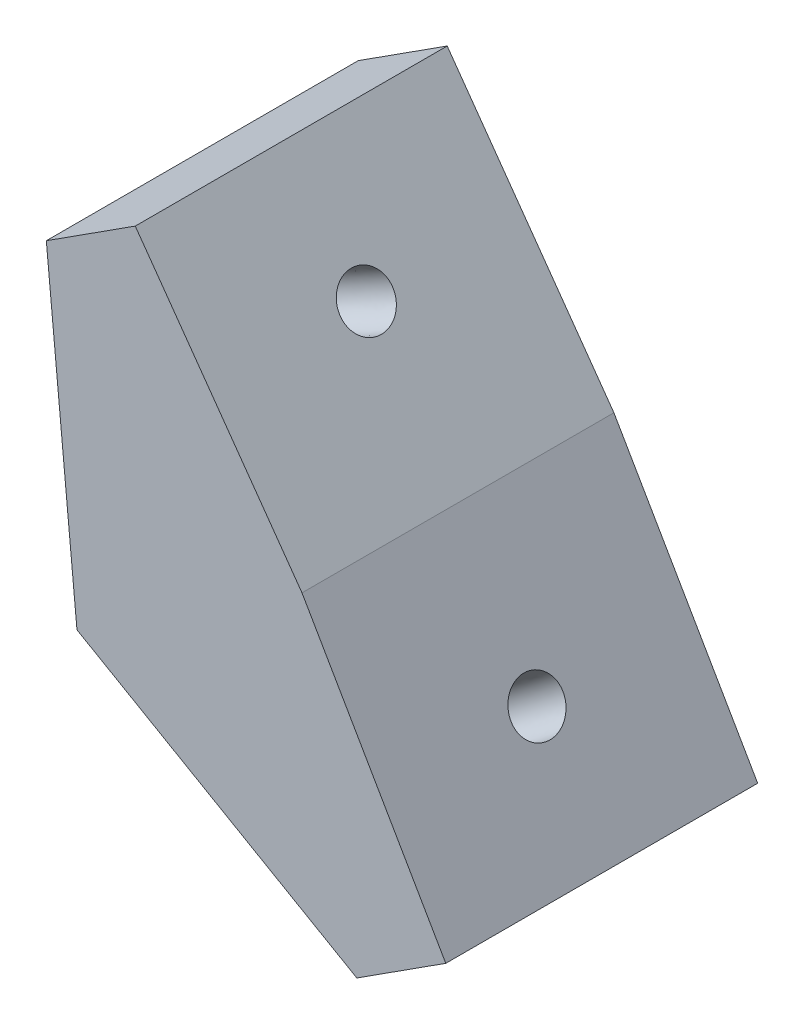
ISO-10303-21;
HEADER;
FILE_DESCRIPTION(('STEP AP214'),'2;1');
FILE_NAME('part.step','',(''),(''),'','','');
FILE_SCHEMA(('AUTOMOTIVE_DESIGN { 1 0 10303 214 1 1 1 1 }'));
ENDSEC;
DATA;
#1=APPLICATION_CONTEXT('core data for automotive mechanical design processes');
#2=APPLICATION_PROTOCOL_DEFINITION('international standard','automotive_design',2000,#1);
#3=PRODUCT_CONTEXT('',#1,'mechanical');
#4=PRODUCT('Part','Part','',(#3));
#5=PRODUCT_RELATED_PRODUCT_CATEGORY('part','',(#4));
#6=PRODUCT_DEFINITION_FORMATION('','',#4);
#7=PRODUCT_DEFINITION_CONTEXT('part definition',#1,'design');
#8=PRODUCT_DEFINITION('design','',#6,#7);
#9=PRODUCT_DEFINITION_SHAPE('','',#8);
#10=(LENGTH_UNIT() NAMED_UNIT(*) SI_UNIT(.MILLI.,.METRE.));
#11=(NAMED_UNIT(*) PLANE_ANGLE_UNIT() SI_UNIT($,.RADIAN.));
#12=(NAMED_UNIT(*) SI_UNIT($,.STERADIAN.) SOLID_ANGLE_UNIT());
#13=UNCERTAINTY_MEASURE_WITH_UNIT(LENGTH_MEASURE(1.E-05),#10,'distance_accuracy_value','');
#14=(GEOMETRIC_REPRESENTATION_CONTEXT(3) GLOBAL_UNCERTAINTY_ASSIGNED_CONTEXT((#13)) GLOBAL_UNIT_ASSIGNED_CONTEXT((#10,
#11,#12)) REPRESENTATION_CONTEXT('',''));
#15=CARTESIAN_POINT('',(0.,0.,0.));
#16=DIRECTION('',(0.,0.,1.));
#17=DIRECTION('',(1.,0.,0.));
#18=AXIS2_PLACEMENT_3D('',#15,#16,#17);
#19=CARTESIAN_POINT('',(-8.04908347678806,7.82676257019965,7.5));
#20=DIRECTION('',(-0.866025403784439,-0.499999999999999,0.));
#21=DIRECTION('',(0.499999999999999,-0.866025403784439,0.));
#22=AXIS2_PLACEMENT_3D('',#19,#20,#21);
#23=PLANE('',#22);
#24=DIRECTION('',(-0.499999999999999,0.866025403784439,0.));
#25=VECTOR('',#24,1.);
#26=CARTESIAN_POINT('',(-8.04908347678806,7.82676257019965,-7.5));
#27=LINE('',#26,#25);
#28=CARTESIAN_POINT('',(-8.04908347678806,7.82676257019965,-7.5));
#29=VERTEX_POINT('',#28);
#30=CARTESIAN_POINT('',(-14.9625241732557,19.801193111596,-7.5));
#31=VERTEX_POINT('',#30);
#32=EDGE_CURVE('E153',#29,#31,#27,.T.);
#33=ORIENTED_EDGE('',*,*,#32,.T.);
#34=DIRECTION('',(0.,0.,-1.));
#35=VECTOR('',#34,1.);
#36=CARTESIAN_POINT('',(-14.9625241732557,19.801193111596,7.5));
#37=LINE('',#36,#35);
#38=CARTESIAN_POINT('',(-14.9625241732557,19.801193111596,7.5));
#39=VERTEX_POINT('',#38);
#40=EDGE_CURVE('E123',#39,#31,#37,.T.);
#41=ORIENTED_EDGE('',*,*,#40,.F.);
#42=DIRECTION('',(-0.499999999999999,0.866025403784439,0.));
#43=VECTOR('',#42,1.);
#44=CARTESIAN_POINT('',(-8.04908347678806,7.82676257019965,7.5));
#45=LINE('',#44,#43);
#46=CARTESIAN_POINT('',(-8.04908347678806,7.82676257019965,7.5));
#47=VERTEX_POINT('',#46);
#48=EDGE_CURVE('E86',#47,#39,#45,.T.);
#49=ORIENTED_EDGE('',*,*,#48,.F.);
#50=DIRECTION('',(0.,0.,-1.));
#51=VECTOR('',#50,1.);
#52=CARTESIAN_POINT('',(-8.04908347678806,7.82676257019965,7.5));
#53=LINE('',#52,#51);
#54=EDGE_CURVE('E11',#47,#29,#53,.T.);
#55=ORIENTED_EDGE('',*,*,#54,.T.);
#56=EDGE_LOOP('',(#33,#41,#49,#55));
#57=FACE_BOUND('',#56,.T.);
#58=CARTESIAN_POINT('',(-11.7882920789333,14.3032618492139,0.));
#59=CARTESIAN_POINT('',(-11.7882903877033,14.3032589199176,0.0692359962382509));
#60=CARTESIAN_POINT('',(-11.7854052994968,14.2982618005596,0.138544678433381));
#61=CARTESIAN_POINT('',(-11.7739405095316,14.2784042018417,0.275212310269475));
#62=CARTESIAN_POINT('',(-11.7653608077728,14.2635437224818,0.342571259910438));
#63=CARTESIAN_POINT('',(-11.7427454118136,14.2243727076471,0.473530737806469));
#64=CARTESIAN_POINT('',(-11.7287097176131,14.2000621721723,0.537131266061537));
#65=CARTESIAN_POINT('',(-11.6955689293954,14.1426606431763,0.658806539190552));
#66=CARTESIAN_POINT('',(-11.6764638353782,14.1095696496552,0.716881284064499));
#67=CARTESIAN_POINT('',(-11.6337113342174,14.0355201454941,0.825906739801367));
#68=CARTESIAN_POINT('',(-11.6100639270738,13.9945616348541,0.876857450664289));
#69=CARTESIAN_POINT('',(-11.5588789891499,13.9059067217877,0.970228602792982));
#70=CARTESIAN_POINT('',(-11.5313414583697,13.8582103193613,1.01264904405875));
#71=CARTESIAN_POINT('',(-11.4731358058845,13.7573951719691,1.08778989703168));
#72=CARTESIAN_POINT('',(-11.4424676841794,13.7042764270034,1.12051030873884));
#73=CARTESIAN_POINT('',(-11.3788467155563,13.5940816769214,1.17534856129659));
#74=CARTESIAN_POINT('',(-11.3458938686382,13.5370056718052,1.19746640214719));
#75=CARTESIAN_POINT('',(-11.2786123345948,13.4204706364308,1.23048949109687));
#76=CARTESIAN_POINT('',(-11.2442836474695,13.3610116061727,1.24139473919595));
#77=CARTESIAN_POINT('',(-11.1751972646293,13.2413504809824,1.25169185621386));
#78=CARTESIAN_POINT('',(-11.1404395689145,13.1811483860502,1.25108372513269));
#79=CARTESIAN_POINT('',(-11.0714538334015,13.0616615871443,1.23837085817757));
#80=CARTESIAN_POINT('',(-11.0372257936034,13.0023768831705,1.22626612230363));
#81=CARTESIAN_POINT('',(-10.9702434257341,12.8863600188095,1.19089391046827));
#82=CARTESIAN_POINT('',(-10.9374890976628,12.8296278584223,1.16762643450686));
#83=CARTESIAN_POINT('',(-10.8743575621041,12.7202808312747,1.11057049117791));
#84=CARTESIAN_POINT('',(-10.8439803546166,12.6676659645143,1.07678202381037));
#85=CARTESIAN_POINT('',(-10.7864409048635,12.5680047141024,0.999616029463532));
#86=CARTESIAN_POINT('',(-10.7592786625978,12.5209583304508,0.956238502484234));
#87=CARTESIAN_POINT('',(-10.7089183148205,12.4337316494136,0.861090800027518));
#88=CARTESIAN_POINT('',(-10.6857202093089,12.3935513520281,0.809320624550101));
#89=CARTESIAN_POINT('',(-10.6439279702957,12.3211650706952,0.698815516846221));
#90=CARTESIAN_POINT('',(-10.6253338367942,12.2889590867479,0.640080584619759));
#91=CARTESIAN_POINT('',(-10.5932623932569,12.2334097170692,0.517265952619418));
#92=CARTESIAN_POINT('',(-10.5797850832211,12.2100663313378,0.45318625284554));
#93=CARTESIAN_POINT('',(-10.5583190091299,12.1728860003729,0.321449490899288));
#94=CARTESIAN_POINT('',(-10.5503302450746,12.1590490551394,0.253792428726914));
#95=CARTESIAN_POINT('',(-10.5400616039071,12.1412632469125,0.116767015646271));
#96=CARTESIAN_POINT('',(-10.5377817267948,12.1373143839191,0.0473986647380021));
#97=CARTESIAN_POINT('',(-10.5389937416205,12.1394136551767,-0.091136052484365));
#98=CARTESIAN_POINT('',(-10.5424856335584,12.1454617894277,-0.160302418798464));
#99=CARTESIAN_POINT('',(-10.5551448753623,12.1673882394174,-0.29652546451185));
#100=CARTESIAN_POINT('',(-10.5643122252283,12.1832665551561,-0.363582143911137));
#101=CARTESIAN_POINT('',(-10.5880695349285,12.224415422608,-0.493736301504609));
#102=CARTESIAN_POINT('',(-10.6026594947627,12.2496859743212,-0.556833779698793));
#103=CARTESIAN_POINT('',(-10.6368596134919,12.308922317585,-0.677329220738223));
#104=CARTESIAN_POINT('',(-10.6564697723868,12.3428881091355,-0.734727183583468));
#105=CARTESIAN_POINT('',(-10.7001694144218,12.4185781094127,-0.842240480155007));
#106=CARTESIAN_POINT('',(-10.7242588975618,12.4603023181393,-0.8923558138813));
#107=CARTESIAN_POINT('',(-10.7762527674249,12.5503583424242,-0.983921603247795));
#108=CARTESIAN_POINT('',(-10.8041571541479,12.5986901579825,-1.025372058888));
#109=CARTESIAN_POINT('',(-10.8630111902937,12.7006283388176,-1.09846483221743));
#110=CARTESIAN_POINT('',(-10.8939608397165,12.7542347040943,-1.13010714990666));
#111=CARTESIAN_POINT('',(-10.9580517678942,12.8652434480023,-1.18271090924779));
#112=CARTESIAN_POINT('',(-10.991193046649,12.9226458266335,-1.20367235089969));
#113=CARTESIAN_POINT('',(-11.058753152022,13.0396633617041,-1.23433621309854));
#114=CARTESIAN_POINT('',(-11.0931719786401,13.0992785181436,-1.24403863364549));
#115=CARTESIAN_POINT('',(-11.1623378617193,13.2190773417873,-1.2519168478413));
#116=CARTESIAN_POINT('',(-11.1970849181805,13.2792610089915,-1.25009264149015));
#117=CARTESIAN_POINT('',(-11.2659488900731,13.3985369071204,-1.23496791544555));
#118=CARTESIAN_POINT('',(-11.3000658055044,13.457629138045,-1.22166739575209));
#119=CARTESIAN_POINT('',(-11.3667285039678,13.5730923187532,-1.18395689140882));
#120=CARTESIAN_POINT('',(-11.3992742869999,13.6294632685369,-1.15954690675901));
#121=CARTESIAN_POINT('',(-11.4618970656563,13.7379291028809,-1.10029072560949));
#122=CARTESIAN_POINT('',(-11.4919740612807,13.7900239874414,-1.06544452910978));
#123=CARTESIAN_POINT('',(-11.5488296936821,13.8885008314571,-0.986277057386749));
#124=CARTESIAN_POINT('',(-11.5756083304592,13.9348827909125,-0.941955782163436));
#125=CARTESIAN_POINT('',(-11.6251286803112,14.0206545528647,-0.84506049057769));
#126=CARTESIAN_POINT('',(-11.6478703933861,14.0600443553616,-0.792486474215257));
#127=CARTESIAN_POINT('',(-11.6886895502857,14.1307452090338,-0.680536148947652));
#128=CARTESIAN_POINT('',(-11.7067669941104,14.1620562602092,-0.621159840042481));
#129=CARTESIAN_POINT('',(-11.7377593786004,14.2157366447937,-0.49724116902249));
#130=CARTESIAN_POINT('',(-11.7506743192658,14.2381059782028,-0.43269880690767));
#131=CARTESIAN_POINT('',(-11.7698166937878,14.2712615434524,-0.307847781127855));
#132=CARTESIAN_POINT('',(-11.776642248308,14.2830837506712,-0.247905408153965));
#133=CARTESIAN_POINT('',(-11.7835765050165,14.2950942356031,-0.156421509780714));
#134=CARTESIAN_POINT('',(-11.785337645046,14.2981446196134,-0.125351349232774));
#135=CARTESIAN_POINT('',(-11.7876991401056,14.3022348490385,-0.0628597828360439));
#136=CARTESIAN_POINT('',(-11.7882928468554,14.3032631792939,-0.0314373843093596));
#137=CARTESIAN_POINT('',(-11.7882920789333,14.3032618492139,0.));
#138=B_SPLINE_CURVE_WITH_KNOTS('',3,(#58,#59,#60,#61,#62,#63,#64,#65,#66,#67,#68,#69,#70,#71,
#72,#73,#74,#75,#76,#77,#78,#79,#80,#81,#82,#83,#84,#85,#86,#87,#88,#89,#90,#91,#92,#93,#94,#95,
#96,#97,#98,#99,#100,#101,#102,#103,#104,#105,#106,#107,#108,#109,#110,#111,#112,#113,#114,#115,
#116,#117,#118,#119,#120,#121,#122,#123,#124,#125,#126,#127,#128,#129,#130,#131,#132,#133,#134,
#135,#136,#137),.UNSPECIFIED.,.T.,.F.,(4,2,2,2,2,2,2,2,2,2,2,2,2,2,2,2,2,2,2,2,2,2,2,2,2,2,2,2,
2,2,2,2,2,2,2,2,2,2,2,4),(0.,0.207595452974777,0.415190905949554,0.62278635892433,
0.830381811899108,1.03797726487388,1.24557271784866,1.45316817082343,1.66076362379821,
1.86835907677298,2.07595452974775,2.28354998272253,2.4911454356973,2.69874088867207,
2.90633634164685,3.11393179462163,3.3215272475964,3.52912270057118,3.73671815354596,
3.94431360652073,4.15190905949551,4.35950451247028,4.56709996544506,4.77469541841983,
4.98229087139461,5.18988632436938,5.39748177734416,5.60507723031893,5.81267268329371,
6.02026813626848,6.22786358924325,6.43545904221803,6.6430544951928,6.85064994816757,
7.05824540114235,7.26584085411712,7.4734363070919,7.65716624205797,7.75089505982163,
7.84515611462863),.UNSPECIFIED.);
#139=CARTESIAN_POINT('',(-11.7882920789333,14.3032618492139,0.));
#140=VERTEX_POINT('',#139);
#141=EDGE_CURVE('E162',#140,#140,#138,.T.);
#142=ORIENTED_EDGE('',*,*,#141,.F.);
#143=EDGE_LOOP('',(#142));
#144=FACE_BOUND('',#143,.T.);
#145=ADVANCED_FACE('F38',(#57,#144),#23,.F.);
#146=CARTESIAN_POINT('',(-25.7839240841938,12.848135855454,7.5));
#147=DIRECTION('',(0.499999999999999,0.866025403784439,0.));
#148=DIRECTION('',(-0.866025403784439,0.5,0.));
#149=AXIS2_PLACEMENT_3D('',#146,#147,#148);
#150=PLANE('',#149);
#151=DIRECTION('',(0.866025403784439,-0.499999999999999,0.));
#152=VECTOR('',#151,1.);
#153=CARTESIAN_POINT('',(-25.7839240841938,12.848135855454,-7.5));
#154=LINE('',#153,#152);
#155=CARTESIAN_POINT('',(-25.7839240841938,12.848135855454,-7.5));
#156=VERTEX_POINT('',#155);
#157=CARTESIAN_POINT('',(-12.3261586807003,5.0782913770562,-7.5));
#158=VERTEX_POINT('',#157);
#159=EDGE_CURVE('E79',#156,#158,#154,.T.);
#160=ORIENTED_EDGE('',*,*,#159,.T.);
#161=DIRECTION('',(0.,0.,-1.));
#162=VECTOR('',#161,1.);
#163=CARTESIAN_POINT('',(-12.3261586807003,5.0782913770562,7.5));
#164=LINE('',#163,#162);
#165=CARTESIAN_POINT('',(-12.3261586807003,5.0782913770562,7.5));
#166=VERTEX_POINT('',#165);
#167=EDGE_CURVE('E53',#166,#158,#164,.T.);
#168=ORIENTED_EDGE('',*,*,#167,.F.);
#169=DIRECTION('',(0.866025403784439,-0.499999999999999,0.));
#170=VECTOR('',#169,1.);
#171=CARTESIAN_POINT('',(-25.7839240841938,12.848135855454,7.5));
#172=LINE('',#171,#170);
#173=CARTESIAN_POINT('',(-25.7839240841938,12.848135855454,7.5));
#174=VERTEX_POINT('',#173);
#175=EDGE_CURVE('E62',#174,#166,#172,.T.);
#176=ORIENTED_EDGE('',*,*,#175,.F.);
#177=DIRECTION('',(0.,0.,-1.));
#178=VECTOR('',#177,1.);
#179=CARTESIAN_POINT('',(-25.7839240841938,12.848135855454,7.5));
#180=LINE('',#179,#178);
#181=EDGE_CURVE('E76',#174,#156,#180,.T.);
#182=ORIENTED_EDGE('',*,*,#181,.T.);
#183=EDGE_LOOP('',(#160,#168,#176,#182));
#184=FACE_BOUND('',#183,.T.);
#185=CARTESIAN_POINT('',(-18.9694980877571,8.91382517203852,0.));
#186=CARTESIAN_POINT('',(-18.9695002867095,8.91382644160426,-0.0326198593364432));
#187=CARTESIAN_POINT('',(-18.9683069101205,8.91313744530941,-0.0652249759464828));
#188=CARTESIAN_POINT('',(-18.9611998724466,8.90903419519516,-0.162058894340575));
#189=CARTESIAN_POINT('',(-18.9518090596245,8.90361240688433,-0.226000253886946));
#190=CARTESIAN_POINT('',(-18.9238625697643,8.88747749344087,-0.352028601236673));
#191=CARTESIAN_POINT('',(-18.905183807905,8.8766933052536,-0.41407847052515));
#192=CARTESIAN_POINT('',(-18.8592997326005,8.85020212202414,-0.533849840437851));
#193=CARTESIAN_POINT('',(-18.8320940121261,8.83449489198345,-0.591571134277046));
#194=CARTESIAN_POINT('',(-18.7853974878147,8.80753464110281,-0.674262576103965));
#195=CARTESIAN_POINT('',(-18.7686883907982,8.79788763944314,-0.701384232354124));
#196=CARTESIAN_POINT('',(-18.7334667333901,8.77755240605783,-0.754006779519602));
#197=CARTESIAN_POINT('',(-18.7149547001531,8.76686447868502,-0.779508140605713));
#198=CARTESIAN_POINT('',(-18.6564820722562,8.73310529122823,-0.85394481906787));
#199=CARTESIAN_POINT('',(-18.6139271484951,8.70853619453955,-0.900210371413862));
#200=CARTESIAN_POINT('',(-18.5232141838408,8.65616303997752,-0.984759288054414));
#201=CARTESIAN_POINT('',(-18.4750521777345,8.62835669278725,-1.02303694940061));
#202=CARTESIAN_POINT('',(-18.3973239300165,8.58348026804363,-1.07552936951723));
#203=CARTESIAN_POINT('',(-18.3692587359313,8.56727682068365,-1.09277199291995));
#204=CARTESIAN_POINT('',(-18.3120652005034,8.53425611760849,-1.12462931901239));
#205=CARTESIAN_POINT('',(-18.2829378740989,8.51743944786811,-1.13924645526445));
#206=CARTESIAN_POINT('',(-18.1942022633774,8.46620791913133,-1.17909807797935));
#207=CARTESIAN_POINT('',(-18.133213542946,8.4309960649727,-1.20035075031548));
#208=CARTESIAN_POINT('',(-18.0091893211891,8.3593906471553,-1.23188973708283));
#209=CARTESIAN_POINT('',(-17.9461540324134,8.32299720621223,-1.24217718659547));
#210=CARTESIAN_POINT('',(-17.819457821768,8.24984911489081,-1.2516877712256));
#211=CARTESIAN_POINT('',(-17.7557969242245,8.21309447855722,-1.25091133486448));
#212=CARTESIAN_POINT('',(-17.6292992467414,8.14006101041047,-1.2382988811288));
#213=CARTESIAN_POINT('',(-17.5664624884536,8.10378219109802,-1.22646257377607));
#214=CARTESIAN_POINT('',(-17.4430698209726,8.03254140131186,-1.19186924212257));
#215=CARTESIAN_POINT('',(-17.3825141200573,7.99757955108743,-1.16911122318086));
#216=CARTESIAN_POINT('',(-17.2651908958978,7.92984295603677,-1.11296899676825));
#217=CARTESIAN_POINT('',(-17.2084239613854,7.89706855111495,-1.07958314247999));
#218=CARTESIAN_POINT('',(-17.1002445738222,7.83461115258458,-1.00269266681163));
#219=CARTESIAN_POINT('',(-17.0488332748062,7.80492882525831,-0.959185871069453));
#220=CARTESIAN_POINT('',(-16.9542691061278,7.75033217701616,-0.864147431746054));
#221=CARTESIAN_POINT('',(-16.9109332057154,7.72531218324753,-0.812859533504096));
#222=CARTESIAN_POINT('',(-16.833770387903,7.68076220961209,-0.704559603336214));
#223=CARTESIAN_POINT('',(-16.799657857624,7.66106733107274,-0.647819303655092));
#224=CARTESIAN_POINT('',(-16.7410875385535,7.62725174159089,-0.530304640154718));
#225=CARTESIAN_POINT('',(-16.716365257798,7.61297832614171,-0.469707840126556));
#226=CARTESIAN_POINT('',(-16.6863886018341,7.59567129575149,-0.376654924253461));
#227=CARTESIAN_POINT('',(-16.677642995567,7.59062201761893,-0.345649948251011));
#228=CARTESIAN_POINT('',(-16.6624002008203,7.58182158596871,-0.282878682071813));
#229=CARTESIAN_POINT('',(-16.6559051943138,7.57807169221384,-0.25111168482818));
#230=CARTESIAN_POINT('',(-16.6399111114599,7.56883750417271,-0.154971774267373));
#231=CARTESIAN_POINT('',(-16.6339084251387,7.56537185160927,-0.0897768355313695));
#232=CARTESIAN_POINT('',(-16.6315186425485,7.56399210998751,0.0408347579416641));
#233=CARTESIAN_POINT('',(-16.6351293895364,7.56607677573298,0.106251359660802));
#234=CARTESIAN_POINT('',(-16.6475498753073,7.57324774653629,0.20261402374578));
#235=CARTESIAN_POINT('',(-16.6527951818168,7.57627612566152,0.23421992269247));
#236=CARTESIAN_POINT('',(-16.6655166768926,7.58362088426801,0.296822863825483));
#237=CARTESIAN_POINT('',(-16.6729925534139,7.58793708359002,0.327819990529793));
#238=CARTESIAN_POINT('',(-16.6988944280026,7.60289153785626,0.420381170245223));
#239=CARTESIAN_POINT('',(-16.7206924688531,7.61547664260895,0.480728899783467));
#240=CARTESIAN_POINT('',(-16.7724127198131,7.64533734342371,0.596595540945654));
#241=CARTESIAN_POINT('',(-16.802338503497,7.66261500268993,0.65211231430298));
#242=CARTESIAN_POINT('',(-16.8530495731449,7.69189305240168,0.731616771320882));
#243=CARTESIAN_POINT('',(-16.8712457293951,7.7023986081106,0.757856219514332));
#244=CARTESIAN_POINT('',(-16.9093703945516,7.72440989380119,0.808583963020048));
#245=CARTESIAN_POINT('',(-16.9292983284848,7.73591529182196,0.833072834662534));
#246=CARTESIAN_POINT('',(-16.9919311617943,7.77207637499349,0.904268230283434));
#247=CARTESIAN_POINT('',(-17.0371117132823,7.79816137855712,0.948121569803371));
#248=CARTESIAN_POINT('',(-17.1327157531572,7.85335839671453,1.0274391762351));
#249=CARTESIAN_POINT('',(-17.1831429466891,7.88247255047467,1.06289745592901));
#250=CARTESIAN_POINT('',(-17.2641473069471,7.92924043967516,1.11081950388115));
#251=CARTESIAN_POINT('',(-17.2933633377234,7.94610832290848,1.12642163030772));
#252=CARTESIAN_POINT('',(-17.3527439103014,7.980391712471,1.154893247797));
#253=CARTESIAN_POINT('',(-17.3829075478749,7.9978066967438,1.16776525820702));
#254=CARTESIAN_POINT('',(-17.474576005499,8.0507315054293,1.2022337022968));
#255=CARTESIAN_POINT('',(-17.5372857273035,8.08693698019392,1.21969861611969));
#256=CARTESIAN_POINT('',(-17.6642411742625,8.16023474167083,1.2433242585314));
#257=CARTESIAN_POINT('',(-17.7284867722017,8.19732695493524,1.24948592009621));
#258=CARTESIAN_POINT('',(-17.8570484683909,8.27155208483756,1.25045212787454));
#259=CARTESIAN_POINT('',(-17.9213645656209,8.30868500088649,1.24525683631504));
#260=CARTESIAN_POINT('',(-18.0485585670285,8.38212049183851,1.22356509087975));
#261=CARTESIAN_POINT('',(-18.1114363933282,8.41842302177869,1.20706802653692));
#262=CARTESIAN_POINT('',(-18.2342242719054,8.48931463652848,1.16297774970102));
#263=CARTESIAN_POINT('',(-18.2941339610545,8.52390351168575,1.1353831832615));
#264=CARTESIAN_POINT('',(-18.4093954628623,8.59044977078165,1.06948655053788));
#265=CARTESIAN_POINT('',(-18.4647464158992,8.62240665841738,1.03118247076263));
#266=CARTESIAN_POINT('',(-18.5682973307305,8.68219180697008,0.945294107100679));
#267=CARTESIAN_POINT('',(-18.6166065333009,8.71008313807839,0.897886101819199));
#268=CARTESIAN_POINT('',(-18.7039628421619,8.76051832651467,0.79626222568349));
#269=CARTESIAN_POINT('',(-18.7432882895151,8.78322288413006,0.742366387263723));
#270=CARTESIAN_POINT('',(-18.8123331404455,8.82308594740091,0.629630870101635));
#271=CARTESIAN_POINT('',(-18.8423331630292,8.84040646851534,0.571020932541889));
#272=CARTESIAN_POINT('',(-18.8926772462679,8.86947263852533,0.450472764172556));
#273=CARTESIAN_POINT('',(-18.9132648578936,8.88135890163936,0.388670958306316));
#274=CARTESIAN_POINT('',(-18.9425321330225,8.8982563708135,0.272543511663546));
#275=CARTESIAN_POINT('',(-18.9526235817647,8.90408267146133,0.218685977252467));
#276=CARTESIAN_POINT('',(-18.966102321146,8.91186462527151,0.109871160279212));
#277=CARTESIAN_POINT('',(-18.9694943858777,8.91382303475745,0.0549146890688752));
#278=CARTESIAN_POINT('',(-18.9694980877571,8.91382517203852,0.));
#279=B_SPLINE_CURVE_WITH_KNOTS('',3,(#185,#186,#187,#188,#189,#190,#191,#192,#193,#194,#195,
#196,#197,#198,#199,#200,#201,#202,#203,#204,#205,#206,#207,#208,#209,#210,#211,#212,#213,#214,
#215,#216,#217,#218,#219,#220,#221,#222,#223,#224,#225,#226,#227,#228,#229,#230,#231,#232,#233,
#234,#235,#236,#237,#238,#239,#240,#241,#242,#243,#244,#245,#246,#247,#248,#249,#250,#251,#252,
#253,#254,#255,#256,#257,#258,#259,#260,#261,#262,#263,#264,#265,#266,#267,#268,#269,#270,#271,
#272,#273,#274,#275,#276,#277,#278),.UNSPECIFIED.,.T.,.F.,(4,2,2,2,2,2,2,2,2,2,2,2,2,2,2,2,2,2,
2,2,2,2,2,2,2,2,2,2,2,2,2,2,2,2,2,2,2,2,2,2,2,2,2,2,2,2,4),(0.,0.0978187594870788,
0.291392821452966,0.487603392728062,0.68382333142583,0.783586309793665,0.883320205868106,
1.0849247741888,1.2866727891811,1.39669441792684,1.50661353543787,1.72634557908572,
1.94605487463295,2.16575566052282,2.38546220689751,2.6051887657587,2.82494938854529,
3.04475726792198,3.25872887420816,3.46501581809922,3.66496314544581,3.76269046817581,
3.8605122749024,4.05620929024754,4.25186240529087,4.34831045831194,4.44474502507948,
4.63996962655531,4.83528020297154,4.93603252842857,5.03675152965391,5.24033797974109,
5.44406918987495,5.55547008753989,5.66676773298382,5.88925787864595,6.11172965903582,
6.33419826157614,6.55667888174084,6.77918665380592,7.00173628762817,7.22034640150572,
7.43079938353945,7.63411293471238,7.83181759253335,7.9966104193574,8.16128576963844),.UNSPECIFIED.);
#280=CARTESIAN_POINT('',(-18.9694980877571,8.91382517203852,0.));
#281=VERTEX_POINT('',#280);
#282=EDGE_CURVE('E42',#281,#281,#279,.T.);
#283=ORIENTED_EDGE('',*,*,#282,.F.);
#284=EDGE_LOOP('',(#283));
#285=FACE_BOUND('',#284,.T.);
#286=ADVANCED_FACE('F182',(#184,#285),#150,.F.);
#287=CARTESIAN_POINT('',(-22.9807891802401,31.0657426068962,7.5));
#288=DIRECTION('',(-0.81468475610529,-0.579904085318997,0.));
#289=DIRECTION('',(-0.579904085318998,0.814684756105291,0.));
#290=AXIS2_PLACEMENT_3D('',#287,#288,#289);
#291=PLANE('',#290);
#292=DIRECTION('',(0.579904085318997,-0.814684756105291,0.));
#293=VECTOR('',#292,1.);
#294=CARTESIAN_POINT('',(-22.9807891802401,31.0657426068962,-7.5));
#295=LINE('',#294,#293);
#296=CARTESIAN_POINT('',(-22.9807891802401,31.0657426068962,-7.5));
#297=VERTEX_POINT('',#296);
#298=EDGE_CURVE('E118',#297,#31,#295,.T.);
#299=ORIENTED_EDGE('',*,*,#298,.F.);
#300=DIRECTION('',(0.,0.,-1.));
#301=VECTOR('',#300,1.);
#302=CARTESIAN_POINT('',(-22.9807891802401,31.0657426068962,7.5));
#303=LINE('',#302,#301);
#304=CARTESIAN_POINT('',(-22.9807891802401,31.0657426068962,7.5));
#305=VERTEX_POINT('',#304);
#306=EDGE_CURVE('E114',#305,#297,#303,.T.);
#307=ORIENTED_EDGE('',*,*,#306,.F.);
#308=DIRECTION('',(0.579904085318997,-0.814684756105291,0.));
#309=VECTOR('',#308,1.);
#310=CARTESIAN_POINT('',(-22.9807891802401,31.0657426068962,7.5));
#311=LINE('',#310,#309);
#312=EDGE_CURVE('E103',#305,#39,#311,.T.);
#313=ORIENTED_EDGE('',*,*,#312,.T.);
#314=ORIENTED_EDGE('',*,*,#40,.T.);
#315=EDGE_LOOP('',(#299,#307,#313,#314));
#316=FACE_BOUND('',#315,.T.);
#317=CARTESIAN_POINT('',(-20.0939067193259,27.0100734141524,0.));
#318=CARTESIAN_POINT('',(-20.0939047578258,27.0100706585171,0.0692360020484277));
#319=CARTESIAN_POINT('',(-20.0905586087683,27.0053697834968,0.138544689893089));
#320=CARTESIAN_POINT('',(-20.0772616509049,26.9866894031578,0.275212333058088));
#321=CARTESIAN_POINT('',(-20.0673108420983,26.9727098978381,0.342571288378224));
#322=CARTESIAN_POINT('',(-20.0410813196481,26.9358610591404,0.473530775549582));
#323=CARTESIAN_POINT('',(-20.0248026061776,26.9129917260054,0.537131307503629));
#324=CARTESIAN_POINT('',(-19.9863656483152,26.8589931347999,0.658806584927796));
#325=CARTESIAN_POINT('',(-19.9642074041901,26.8278638771041,0.716881330648712));
#326=CARTESIAN_POINT('',(-19.9146227051485,26.7582042567153,0.825906785032976));
#327=CARTESIAN_POINT('',(-19.8871962505083,26.7196738944105,0.876857494070075));
#328=CARTESIAN_POINT('',(-19.8278315456791,26.6362747232381,0.970228640222198));
#329=CARTESIAN_POINT('',(-19.7958932957327,26.5914059147114,1.01264907779608));
#330=CARTESIAN_POINT('',(-19.728385912782,26.4965674108851,1.08778992225703));
#331=CARTESIAN_POINT('',(-19.6928167799565,26.4465977158365,1.12051032962159));
#332=CARTESIAN_POINT('',(-19.6190286730693,26.3429356665687,1.1753485737496));
#333=CARTESIAN_POINT('',(-19.5808096991115,26.2892433124957,1.1974664109294));
#334=CARTESIAN_POINT('',(-19.5027760416876,26.1796168539556,1.23048949402807));
#335=CARTESIAN_POINT('',(-19.4629613582613,26.1236827495446,1.24139474022733));
#336=CARTESIAN_POINT('',(-19.3828344241266,26.0111155277479,1.25169185572688));
#337=CARTESIAN_POINT('',(-19.3425221734223,25.9544824103677,1.25108372511936));
#338=CARTESIAN_POINT('',(-19.262511971112,25.8420791805831,1.23837086161705));
#339=CARTESIAN_POINT('',(-19.2228140195059,25.7863090681787,1.22626612872282));
#340=CARTESIAN_POINT('',(-19.1451273387637,25.6771700637202,1.19089392548451));
#341=CARTESIAN_POINT('',(-19.1071386096272,25.6238011716657,1.16762645514231));
#342=CARTESIAN_POINT('',(-19.0339181544246,25.5209365942317,1.11057052587764));
#343=CARTESIAN_POINT('',(-18.9986864283578,25.471440908851,1.07678206695801));
#344=CARTESIAN_POINT('',(-18.9319517178478,25.377687902566,0.999616092442691));
#345=CARTESIAN_POINT('',(-18.9004487334033,25.3334305816598,0.956238576850275));
#346=CARTESIAN_POINT('',(-18.8420404007857,25.2513749807118,0.861090899981607));
#347=CARTESIAN_POINT('',(-18.8151350526108,25.2135767006675,0.80932073870851));
#348=CARTESIAN_POINT('',(-18.7666640780264,25.1454817085693,0.698815661746263));
#349=CARTESIAN_POINT('',(-18.7450984516149,25.1151849965127,0.640080746059684));
#350=CARTESIAN_POINT('',(-18.7079017292528,25.0629287640552,0.517266148564569));
#351=CARTESIAN_POINT('',(-18.6922706333004,25.0409692436517,0.453186466757756));
#352=CARTESIAN_POINT('',(-18.6673740982192,25.0059930672046,0.321449740857272));
#353=CARTESIAN_POINT('',(-18.6581086590889,24.992976411159,0.253792696764458));
#354=CARTESIAN_POINT('',(-18.6461989907204,24.9762449800211,0.116767318344559));
#355=CARTESIAN_POINT('',(-18.6435547614812,24.9725302049276,0.0473989840176983));
#356=CARTESIAN_POINT('',(-18.6449604442296,24.9745049940971,-0.0911357032637271));
#357=CARTESIAN_POINT('',(-18.6490103562171,24.98019455836,-0.160302056218293));
#358=CARTESIAN_POINT('',(-18.6636926194935,25.0008211005403,-0.296525080051276));
#359=CARTESIAN_POINT('',(-18.6743249707831,25.0157580784587,-0.363581750929448));
#360=CARTESIAN_POINT('',(-18.7018788583409,25.0544674663266,-0.49373589761612));
#361=CARTESIAN_POINT('',(-18.7188003946106,25.0782398762782,-0.55683337342372));
#362=CARTESIAN_POINT('',(-18.7584659336927,25.133964453585,-0.677328816639022));
#363=CARTESIAN_POINT('',(-18.7812099365069,25.1659166209428,-0.734726784044937));
#364=CARTESIAN_POINT('',(-18.8318930987646,25.2371194296966,-0.842240096936219));
#365=CARTESIAN_POINT('',(-18.8598322582099,25.2763700710952,-0.892355442418927));
#366=CARTESIAN_POINT('',(-18.9201351343023,25.3610872426854,-0.9839212621959));
#367=CARTESIAN_POINT('',(-18.9524988509511,25.4065537728793,-1.0253717364869));
#368=CARTESIAN_POINT('',(-19.0207582066136,25.502448694001,-1.0984645532654));
#369=CARTESIAN_POINT('',(-19.0566538456286,25.5528770849306,-1.13010689574949));
#370=CARTESIAN_POINT('',(-19.1309869958138,25.6573048443865,-1.18271070978751));
#371=CARTESIAN_POINT('',(-19.1694245069848,25.7113042129138,-1.20367218133845));
#372=CARTESIAN_POINT('',(-19.247781242852,25.8213845518272,-1.23433610728954));
#373=CARTESIAN_POINT('',(-19.2877004675485,25.8774655222137,-1.24403856168765));
#374=CARTESIAN_POINT('',(-19.3679196040095,25.9901622754824,-1.25191684642702));
#375=CARTESIAN_POINT('',(-19.408219515774,26.0467780583646,-1.25009267676754));
#376=CARTESIAN_POINT('',(-19.4880885002182,26.1589828966466,-1.23496802596805));
#377=CARTESIAN_POINT('',(-19.5276575728979,26.2145719520464,-1.22166754482876));
#378=CARTESIAN_POINT('',(-19.6049735098625,26.3231901129521,-1.18395711862447));
#379=CARTESIAN_POINT('',(-19.6427203741478,26.3762192184585,-1.15954717356148));
#380=CARTESIAN_POINT('',(-19.7153507868946,26.4782548681331,-1.10029107187566));
#381=CARTESIAN_POINT('',(-19.750234335357,26.5272614123025,-1.06544491525574));
#382=CARTESIAN_POINT('',(-19.8161759729535,26.6199002612131,-0.986277522811566));
#383=CARTESIAN_POINT('',(-19.8472340620891,26.6635325659563,-0.941956286990603));
#384=CARTESIAN_POINT('',(-19.9046681877357,26.7442195413185,-0.845061072829049));
#385=CARTESIAN_POINT('',(-19.9310442242486,26.78127421194,-0.792487094491569));
#386=CARTESIAN_POINT('',(-19.9783866443913,26.8477837416774,-0.680536842650625));
#387=CARTESIAN_POINT('',(-19.999353028023,26.8772386007961,-0.62116056914965));
#388=CARTESIAN_POINT('',(-20.0352982867361,26.9277367005148,-0.497241965104548));
#389=CARTESIAN_POINT('',(-20.0502771618192,26.9487799411176,-0.432699634562047));
#390=CARTESIAN_POINT('',(-20.0724787157329,26.9799700430556,-0.307848511635285));
#391=CARTESIAN_POINT('',(-20.0803950864053,26.9910914451526,-0.247906003851455));
#392=CARTESIAN_POINT('',(-20.0884375319058,27.0023899648852,-0.156421892503018));
#393=CARTESIAN_POINT('',(-20.0904801262713,27.005259526481,-0.125351656955336));
#394=CARTESIAN_POINT('',(-20.0932190207046,27.0091072930339,-0.0628599380053997));
#395=CARTESIAN_POINT('',(-20.0939076099692,27.0100746653827,-0.0314374619132114));
#396=CARTESIAN_POINT('',(-20.0939067193259,27.0100734141524,0.));
#397=B_SPLINE_CURVE_WITH_KNOTS('',3,(#317,#318,#319,#320,#321,#322,#323,#324,#325,#326,#327,
#328,#329,#330,#331,#332,#333,#334,#335,#336,#337,#338,#339,#340,#341,#342,#343,#344,#345,#346,
#347,#348,#349,#350,#351,#352,#353,#354,#355,#356,#357,#358,#359,#360,#361,#362,#363,#364,#365,
#366,#367,#368,#369,#370,#371,#372,#373,#374,#375,#376,#377,#378,#379,#380,#381,#382,#383,#384,
#385,#386,#387,#388,#389,#390,#391,#392,#393,#394,#395,#396),.UNSPECIFIED.,.T.,.F.,(4,2,2,2,2,2,
2,2,2,2,2,2,2,2,2,2,2,2,2,2,2,2,2,2,2,2,2,2,2,2,2,2,2,2,2,2,2,2,2,4),(0.,0.20759547011839,
0.41519094025827,0.622786404718687,0.830381859757121,1.0379773039044,1.24557273688468,
1.4531681596456,1.66076357425448,1.86835898367184,2.07595439142695,2.283549799172,
2.49114520688212,2.69874061453628,2.90633602211954,3.11393142962477,3.32152683705337,
3.52912224441514,3.73671765172719,3.94431305901211,4.15190846629543,4.35950387360286,
4.56709928095749,4.77469468837721,4.98229009587279,5.18988550344671,5.39748091109283,
5.60507631879712,5.81267172653918,6.02026713429445,6.22786254203696,6.4354579497421,
6.64305335738935,6.8506487649646,7.05824417246156,7.26583957988253,7.47343498723815,
7.65716535355934,7.75089440007397,7.8451556874404),.UNSPECIFIED.);
#398=CARTESIAN_POINT('',(-20.0939067193259,27.0100734141524,0.));
#399=VERTEX_POINT('',#398);
#400=EDGE_CURVE('E132',#399,#399,#397,.T.);
#401=ORIENTED_EDGE('',*,*,#400,.F.);
#402=EDGE_LOOP('',(#401));
#403=FACE_BOUND('',#402,.T.);
#404=ADVANCED_FACE('F115',(#316,#403),#291,.F.);
#405=CARTESIAN_POINT('',(-25.7839240841938,12.848135855454,7.5));
#406=DIRECTION('',(0.99548973752261,0.0948692915919834,0.));
#407=DIRECTION('',(0.0948692915919836,-0.995489737522611,0.));
#408=AXIS2_PLACEMENT_3D('',#405,#406,#407);
#409=PLANE('',#408);
#410=DIRECTION('',(-0.0948692915919836,0.99548973752261,0.));
#411=VECTOR('',#410,1.);
#412=CARTESIAN_POINT('',(-25.7839240841938,12.848135855454,-7.5));
#413=LINE('',#412,#411);
#414=CARTESIAN_POINT('',(-27.2581633670848,28.3177367362376,-7.5));
#415=VERTEX_POINT('',#414);
#416=EDGE_CURVE('E128',#156,#415,#413,.T.);
#417=ORIENTED_EDGE('',*,*,#416,.F.);
#418=ORIENTED_EDGE('',*,*,#181,.F.);
#419=DIRECTION('',(-0.0948692915919836,0.99548973752261,0.));
#420=VECTOR('',#419,1.);
#421=CARTESIAN_POINT('',(-25.7839240841938,12.848135855454,7.5));
#422=LINE('',#421,#420);
#423=CARTESIAN_POINT('',(-27.2581633670848,28.3177367362376,7.5));
#424=VERTEX_POINT('',#423);
#425=EDGE_CURVE('E111',#174,#424,#422,.T.);
#426=ORIENTED_EDGE('',*,*,#425,.T.);
#427=DIRECTION('',(0.,0.,-1.));
#428=VECTOR('',#427,1.);
#429=CARTESIAN_POINT('',(-27.2581633670848,28.3177367362376,7.5));
#430=LINE('',#429,#428);
#431=EDGE_CURVE('E127',#424,#415,#430,.T.);
#432=ORIENTED_EDGE('',*,*,#431,.T.);
#433=EDGE_LOOP('',(#417,#418,#426,#432));
#434=FACE_BOUND('',#433,.T.);
#435=CARTESIAN_POINT('',(-26.7864324641145,23.3677337911443,0.));
#436=CARTESIAN_POINT('',(-26.7864327143387,23.3677364168162,-0.0326199461624382));
#437=CARTESIAN_POINT('',(-26.7863019795576,23.3663645805697,-0.0652246699183741));
#438=CARTESIAN_POINT('',(-26.785523428855,23.3581950325359,-0.162057565292858));
#439=CARTESIAN_POINT('',(-26.7844947177354,23.347400482,-0.225998554486177));
#440=CARTESIAN_POINT('',(-26.7814333534989,23.3152767396461,-0.352024931138862));
#441=CARTESIAN_POINT('',(-26.7793872337959,23.2938062392112,-0.414073243934448));
#442=CARTESIAN_POINT('',(-26.7743609061079,23.2410635914471,-0.533843757236781));
#443=CARTESIAN_POINT('',(-26.7713806226775,23.2097906524493,-0.591565607861353));
#444=CARTESIAN_POINT('',(-26.7662652055245,23.1561131642533,-0.674257490563057));
#445=CARTESIAN_POINT('',(-26.764434803912,23.1369062534517,-0.701379094258519));
#446=CARTESIAN_POINT('',(-26.7605764495148,23.0964194727217,-0.754001418609953));
#447=CARTESIAN_POINT('',(-26.7585485554508,23.075140218967,-0.779502617360144));
#448=CARTESIAN_POINT('',(-26.7521431863473,23.0079269078912,-0.853938942837356));
#449=CARTESIAN_POINT('',(-26.7474815169094,22.9590107200772,-0.900204340046555));
#450=CARTESIAN_POINT('',(-26.7375443853608,22.854737648032,-0.98475313327709));
#451=CARTESIAN_POINT('',(-26.7322684884036,22.7993762008342,-1.02303082014769));
#452=CARTESIAN_POINT('',(-26.7237537339482,22.7100285253577,-1.07552361250287));
#453=CARTESIAN_POINT('',(-26.7206793065642,22.6777677077825,-1.09276649097452));
#454=CARTESIAN_POINT('',(-26.7144139873716,22.6120239791862,-1.12462433427675));
#455=CARTESIAN_POINT('',(-26.7112232067446,22.5785422348242,-1.13924173262767));
#456=CARTESIAN_POINT('',(-26.7015025787792,22.4765409948081,-1.17909415794416));
#457=CARTESIAN_POINT('',(-26.6948215089204,22.4064346793875,-1.2003473879447));
#458=CARTESIAN_POINT('',(-26.681235147227,22.2638692252871,-1.23188755981448));
#459=CARTESIAN_POINT('',(-26.6743298786798,22.1914103309677,-1.24217563689358));
#460=CARTESIAN_POINT('',(-26.6604507975691,22.0457732909928,-1.25168755627473));
#461=CARTESIAN_POINT('',(-26.6534769876713,21.9725951733088,-1.25091182717316));
#462=CARTESIAN_POINT('',(-26.6396196345663,21.8271861313132,-1.23830085849194));
#463=CARTESIAN_POINT('',(-26.6327360937306,21.7549552318849,-1.22646532895953));
#464=CARTESIAN_POINT('',(-26.6192188543751,21.6131150976097,-1.1918735939834));
#465=CARTESIAN_POINT('',(-26.6125851786708,21.5435061021707,-1.16911639386858));
#466=CARTESIAN_POINT('',(-26.5997327889006,21.4086424186321,-1.11297579634154));
#467=CARTESIAN_POINT('',(-26.5935141393292,21.3433884072891,-1.07959075201112));
#468=CARTESIAN_POINT('',(-26.5816633835697,21.2190351466873,-1.00270182092632));
#469=CARTESIAN_POINT('',(-26.5760314038077,21.1599372240514,-0.959195759620247));
#470=CARTESIAN_POINT('',(-26.5656721009598,21.0512341917008,-0.864158554367596));
#471=CARTESIAN_POINT('',(-26.560924729038,21.0014187040018,-0.812871147270839));
#472=CARTESIAN_POINT('',(-26.5524716714421,20.9127184307495,-0.704572202877306));
#473=CARTESIAN_POINT('',(-26.5487346945187,20.8735052974564,-0.647832438432884));
#474=CARTESIAN_POINT('',(-26.5423183860345,20.8061771964277,-0.530318874032892));
#475=CARTESIAN_POINT('',(-26.5396100770212,20.777758160263,-0.469722666280489));
#476=CARTESIAN_POINT('',(-26.5363261286397,20.7432987808633,-0.376670604477088));
#477=CARTESIAN_POINT('',(-26.5353680417135,20.7332453095385,-0.345665960757745));
#478=CARTESIAN_POINT('',(-26.5336981696702,20.7157228799494,-0.282895319756789));
#479=CARTESIAN_POINT('',(-26.5329866235768,20.7082564298266,-0.251128615368638));
#480=CARTESIAN_POINT('',(-26.5312344021698,20.689869885569,-0.154989675378137));
#481=CARTESIAN_POINT('',(-26.530576735815,20.6829688104591,-0.0897953554446711));
#482=CARTESIAN_POINT('',(-26.5303147415076,20.6802196316691,0.0408151837599234));
#483=CARTESIAN_POINT('',(-26.5307101772769,20.6843690486574,0.10623134996777));
#484=CARTESIAN_POINT('',(-26.5320706262994,20.6986446168372,0.202593484021937));
#485=CARTESIAN_POINT('',(-26.5326451727763,20.7046734920601,0.234199217312338));
#486=CARTESIAN_POINT('',(-26.5340386481703,20.7192956150984,0.296801873669986));
#487=CARTESIAN_POINT('',(-26.5348575429027,20.727888504205,0.32779888125263));
#488=CARTESIAN_POINT('',(-26.5376948129204,20.7576607638876,0.420359768445529));
#489=CARTESIAN_POINT('',(-26.5400825795826,20.7827162604354,0.480707397762966));
#490=CARTESIAN_POINT('',(-26.5457480786915,20.8421659108529,0.596574040929143));
#491=CARTESIAN_POINT('',(-26.5490262026352,20.8765641728093,0.6520909164455));
#492=CARTESIAN_POINT('',(-26.5545812076393,20.9348543780052,0.731595737569107));
#493=CARTESIAN_POINT('',(-26.5565744612665,20.9557701400734,0.75783536586766));
#494=CARTESIAN_POINT('',(-26.5607507408399,20.9995929976791,0.808563522589317));
#495=CARTESIAN_POINT('',(-26.5629337037944,21.0224994322278,0.833052627376307));
#496=CARTESIAN_POINT('',(-26.5697946903821,21.0944936636867,0.904248800533463));
#497=CARTESIAN_POINT('',(-26.5747439118369,21.1464272144103,0.948102773349902));
#498=CARTESIAN_POINT('',(-26.5852167004997,21.2563210848304,1.02742190863104));
#499=CARTESIAN_POINT('',(-26.5907406736179,21.3142856638561,1.0628810837016));
#500=CARTESIAN_POINT('',(-26.599614222961,21.4073982734075,1.11080491138602));
#501=CARTESIAN_POINT('',(-26.6028146909888,21.4409816703476,1.12640779477169));
#502=CARTESIAN_POINT('',(-26.6093195374564,21.5092388249437,1.15488095697483));
#503=CARTESIAN_POINT('',(-26.6126238168379,21.5439115431544,1.16775375509019));
#504=CARTESIAN_POINT('',(-26.622665657549,21.6492833574262,1.20222461155728));
#505=CARTESIAN_POINT('',(-26.6295352183518,21.721367560499,1.21969120057378));
#506=CARTESIAN_POINT('',(-26.6434426256224,21.8673018347097,1.24332033000955));
#507=CARTESIAN_POINT('',(-26.6504804581494,21.941151759564,1.24948380358645));
#508=CARTESIAN_POINT('',(-26.6645638731301,22.0889329313985,1.25045376271364));
#509=CARTESIAN_POINT('',(-26.6716094554715,22.1628641772011,1.2452604106286));
#510=CARTESIAN_POINT('',(-26.6855431037887,22.3090738059778,1.22357263908169));
#511=CARTESIAN_POINT('',(-26.6924311612361,22.381352099462,1.207077609244));
#512=CARTESIAN_POINT('',(-26.705882205179,22.5224976269489,1.16299144072421));
#513=CARTESIAN_POINT('',(-26.7124451519004,22.5913644435914,1.13539894812528));
#514=CARTESIAN_POINT('',(-26.7250717886985,22.7238592387047,1.06950641002339));
#515=CARTESIAN_POINT('',(-26.7311353846123,22.7874862290977,1.03120435096754));
#516=CARTESIAN_POINT('',(-26.7424793106409,22.9065211850377,0.945319419922236));
#517=CARTESIAN_POINT('',(-26.7477716001876,22.962054644214,0.897912729899898));
#518=CARTESIAN_POINT('',(-26.7573415415992,23.0624746885098,0.79629116231687));
#519=CARTESIAN_POINT('',(-26.7616496876763,23.1076812578378,0.742396375844405));
#520=CARTESIAN_POINT('',(-26.7692136655145,23.187052171085,0.629663077202708));
#521=CARTESIAN_POINT('',(-26.7725002416588,23.2215391243268,0.571054341440828));
#522=CARTESIAN_POINT('',(-26.7780156229714,23.2794135471576,0.450507415172378));
#523=CARTESIAN_POINT('',(-26.7802711120005,23.3030810178838,0.388705710707246));
#524=CARTESIAN_POINT('',(-26.7834626078448,23.3365702672186,0.273123824024063));
#525=CARTESIAN_POINT('',(-26.7845604669354,23.3480904065552,0.219832995354016));
#526=CARTESIAN_POINT('',(-26.7860525403431,23.3637471458446,0.111028862509845));
#527=CARTESIAN_POINT('',(-26.786432038438,23.3677293244033,0.0554924043273941));
#528=CARTESIAN_POINT('',(-26.7864324641145,23.3677337911443,0.));
#529=B_SPLINE_CURVE_WITH_KNOTS('',3,(#435,#436,#437,#438,#439,#440,#441,#442,#443,#444,#445,
#446,#447,#448,#449,#450,#451,#452,#453,#454,#455,#456,#457,#458,#459,#460,#461,#462,#463,#464,
#465,#466,#467,#468,#469,#470,#471,#472,#473,#474,#475,#476,#477,#478,#479,#480,#481,#482,#483,
#484,#485,#486,#487,#488,#489,#490,#491,#492,#493,#494,#495,#496,#497,#498,#499,#500,#501,#502,
#503,#504,#505,#506,#507,#508,#509,#510,#511,#512,#513,#514,#515,#516,#517,#518,#519,#520,#521,
#522,#523,#524,#525,#526,#527,#528),.UNSPECIFIED.,.T.,.F.,(4,2,2,2,2,2,2,2,2,2,2,2,2,2,2,2,2,2,
2,2,2,2,2,2,2,2,2,2,2,2,2,2,2,2,2,2,2,2,2,2,2,2,2,2,2,2,4),(0.,0.0978181491148911,
0.291390651959256,0.487596384547909,0.683817967266106,0.783580695801314,0.883313851729604,
1.08491728904302,1.28666433092877,1.39668654934924,1.50660625747765,1.72633947812682,
1.946049947834,2.16575190628814,2.38545962479023,2.60518735656775,2.82494915451046,
3.04475821306653,3.25873126935305,3.46501867037404,3.66496562359256,3.76269243039061,
3.8605137208623,4.05620922696453,4.25186082975811,4.34830807464787,4.44474183276764,
4.63996478615074,4.83527371994456,4.93602536907202,5.03674369121513,5.24032871716002,
5.44405851086912,5.55545978147318,5.66675780034419,5.88924868881815,6.11172120816027,
6.33419054690958,6.55667190162791,6.77918040783793,7.00173077701825,7.22034384747727,
7.43079865158687,7.63411297630933,7.83181745796295,7.99491722438654,8.16132351623695),.UNSPECIFIED.);
#530=CARTESIAN_POINT('',(-26.7864324641145,23.3677337911443,0.));
#531=VERTEX_POINT('',#530);
#532=EDGE_CURVE('E156',#531,#531,#529,.T.);
#533=ORIENTED_EDGE('',*,*,#532,.F.);
#534=EDGE_LOOP('',(#533));
#535=FACE_BOUND('',#534,.T.);
#536=ADVANCED_FACE('F163',(#434,#535),#409,.F.);
#537=CARTESIAN_POINT('',(-12.3261586807003,5.0782913770562,7.5));
#538=DIRECTION('',(-0.540607667963984,0.841274835793002,0.));
#539=DIRECTION('',(-0.841274835793003,-0.540607667963984,0.));
#540=AXIS2_PLACEMENT_3D('',#537,#538,#539);
#541=PLANE('',#540);
#542=DIRECTION('',(0.841274835793002,0.540607667963984,0.));
#543=VECTOR('',#542,1.);
#544=CARTESIAN_POINT('',(-12.3261586807003,5.0782913770562,-7.5));
#545=LINE('',#544,#543);
#546=EDGE_CURVE('E122',#158,#29,#545,.T.);
#547=ORIENTED_EDGE('',*,*,#546,.T.);
#548=ORIENTED_EDGE('',*,*,#54,.F.);
#549=DIRECTION('',(0.841274835793002,0.540607667963984,0.));
#550=VECTOR('',#549,1.);
#551=CARTESIAN_POINT('',(-12.3261586807003,5.0782913770562,7.5));
#552=LINE('',#551,#550);
#553=EDGE_CURVE('E147',#166,#47,#552,.T.);
#554=ORIENTED_EDGE('',*,*,#553,.F.);
#555=ORIENTED_EDGE('',*,*,#167,.T.);
#556=EDGE_LOOP('',(#547,#548,#554,#555));
#557=FACE_BOUND('',#556,.T.);
#558=ADVANCED_FACE('F40',(#557),#541,.F.);
#559=CARTESIAN_POINT('',(0.,0.,7.5));
#560=DIRECTION('',(0.,0.,1.));
#561=DIRECTION('',(1.,0.,0.));
#562=AXIS2_PLACEMENT_3D('',#559,#560,#561);
#563=PLANE('',#562);
#564=ORIENTED_EDGE('',*,*,#553,.T.);
#565=ORIENTED_EDGE('',*,*,#48,.T.);
#566=ORIENTED_EDGE('',*,*,#312,.F.);
#567=DIRECTION('',(0.841333643928349,0.540516141844299,0.));
#568=VECTOR('',#567,1.);
#569=CARTESIAN_POINT('',(-27.2581633670848,28.3177367362376,7.5));
#570=LINE('',#569,#568);
#571=EDGE_CURVE('E107',#424,#305,#570,.T.);
#572=ORIENTED_EDGE('',*,*,#571,.F.);
#573=ORIENTED_EDGE('',*,*,#425,.F.);
#574=ORIENTED_EDGE('',*,*,#175,.T.);
#575=EDGE_LOOP('',(#564,#565,#566,#572,#573,#574));
#576=FACE_BOUND('',#575,.T.);
#577=ADVANCED_FACE('F105',(#576),#563,.T.);
#578=CARTESIAN_POINT('',(0.,0.,-7.5));
#579=DIRECTION('',(0.,0.,1.));
#580=DIRECTION('',(1.,0.,0.));
#581=AXIS2_PLACEMENT_3D('',#578,#579,#580);
#582=PLANE('',#581);
#583=ORIENTED_EDGE('',*,*,#546,.F.);
#584=ORIENTED_EDGE('',*,*,#159,.F.);
#585=ORIENTED_EDGE('',*,*,#416,.T.);
#586=DIRECTION('',(0.841333643928349,0.540516141844299,0.));
#587=VECTOR('',#586,1.);
#588=CARTESIAN_POINT('',(-27.2581633670848,28.3177367362376,-7.5));
#589=LINE('',#588,#587);
#590=EDGE_CURVE('E141',#415,#297,#589,.T.);
#591=ORIENTED_EDGE('',*,*,#590,.T.);
#592=ORIENTED_EDGE('',*,*,#298,.T.);
#593=ORIENTED_EDGE('',*,*,#32,.F.);
#594=EDGE_LOOP('',(#583,#584,#585,#591,#592,#593));
#595=FACE_BOUND('',#594,.T.);
#596=ADVANCED_FACE('F186',(#595),#582,.F.);
#597=CARTESIAN_POINT('',(-27.2581633670848,28.3177367362376,7.5));
#598=DIRECTION('',(0.540516141844299,-0.841333643928349,0.));
#599=DIRECTION('',(-0.841333643928349,-0.540516141844299,0.));
#600=AXIS2_PLACEMENT_3D('',#597,#598,#599);
#601=PLANE('',#600);
#602=ORIENTED_EDGE('',*,*,#590,.F.);
#603=ORIENTED_EDGE('',*,*,#431,.F.);
#604=ORIENTED_EDGE('',*,*,#571,.T.);
#605=ORIENTED_EDGE('',*,*,#306,.T.);
#606=EDGE_LOOP('',(#602,#603,#604,#605));
#607=FACE_BOUND('',#606,.T.);
#608=ADVANCED_FACE('F125',(#607),#601,.F.);
#609=CARTESIAN_POINT('',(46.9737767406724,62.0981190883246,0.));
#610=DIRECTION('',(0.814684231324581,0.579904822562355,0.));
#611=DIRECTION('',(-0.579904822562355,0.814684231324581,0.));
#612=AXIS2_PLACEMENT_3D('',#609,#610,#611);
#613=CIRCLE('',#612,1.25);
#614=DIRECTION('',(-0.878343679108677,-0.478029686703487,0.));
#615=VECTOR('',#614,1.);
#616=SURFACE_OF_LINEAR_EXTRUSION('',#613,#615);
#617=ORIENTED_EDGE('',*,*,#532,.T.);
#618=EDGE_LOOP('',(#617));
#619=FACE_BOUND('',#618,.T.);
#620=ORIENTED_EDGE('',*,*,#400,.T.);
#621=EDGE_LOOP('',(#620));
#622=FACE_BOUND('',#621,.T.);
#623=ADVANCED_FACE('F165',(#619,#622),#616,.T.);
#624=CARTESIAN_POINT('',(49.2479418669317,58.5588696132792,0.));
#625=DIRECTION('',(0.866025403784435,0.500000000000006,0.));
#626=DIRECTION('',(-0.500000000000006,0.866025403784435,0.));
#627=AXIS2_PLACEMENT_3D('',#624,#625,#626);
#628=CIRCLE('',#627,1.25);
#629=DIRECTION('',(-0.799811129525366,-0.600251744759945,0.));
#630=VECTOR('',#629,1.);
#631=SURFACE_OF_LINEAR_EXTRUSION('',#628,#630);
#632=ORIENTED_EDGE('',*,*,#282,.T.);
#633=EDGE_LOOP('',(#632));
#634=FACE_BOUND('',#633,.T.);
#635=ORIENTED_EDGE('',*,*,#141,.T.);
#636=EDGE_LOOP('',(#635));
#637=FACE_BOUND('',#636,.T.);
#638=ADVANCED_FACE('F168',(#634,#637),#631,.T.);
#639=CLOSED_SHELL('',(#145,#286,#404,#536,#558,#577,#596,#608,#623,#638));
#640=MANIFOLD_SOLID_BREP('B2',#639);
#641=ADVANCED_BREP_SHAPE_REPRESENTATION('',(#18,#640),#14);
#642=SHAPE_DEFINITION_REPRESENTATION(#9,#641);
ENDSEC;
END-ISO-10303-21;
